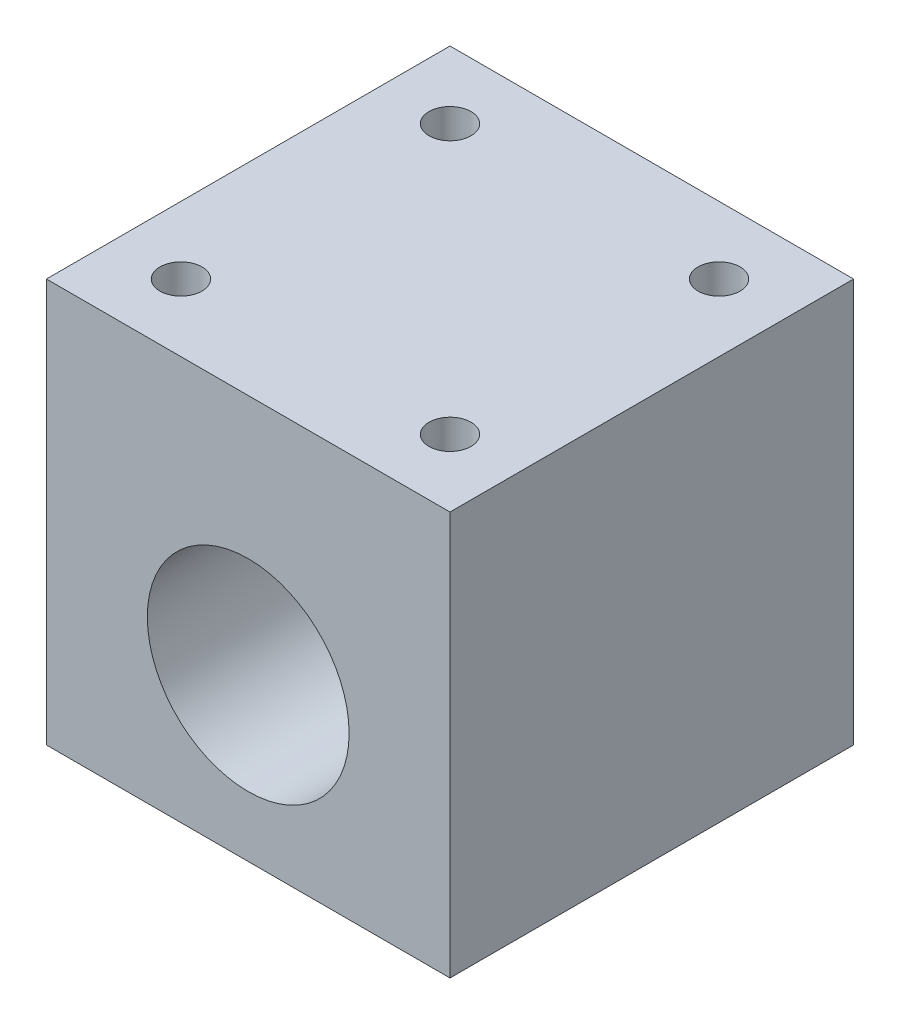
ISO-10303-21;
HEADER;
FILE_DESCRIPTION(('STEP AP214'),'2;1');
FILE_NAME('part.step','',(''),(''),'','','');
FILE_SCHEMA(('AUTOMOTIVE_DESIGN { 1 0 10303 214 1 1 1 1 }'));
ENDSEC;
DATA;
#1=APPLICATION_CONTEXT('core data for automotive mechanical design processes');
#2=APPLICATION_PROTOCOL_DEFINITION('international standard','automotive_design',2000,#1);
#3=PRODUCT_CONTEXT('',#1,'mechanical');
#4=PRODUCT('Part','Part','',(#3));
#5=PRODUCT_RELATED_PRODUCT_CATEGORY('part','',(#4));
#6=PRODUCT_DEFINITION_FORMATION('','',#4);
#7=PRODUCT_DEFINITION_CONTEXT('part definition',#1,'design');
#8=PRODUCT_DEFINITION('design','',#6,#7);
#9=PRODUCT_DEFINITION_SHAPE('','',#8);
#10=(LENGTH_UNIT() NAMED_UNIT(*) SI_UNIT(.MILLI.,.METRE.));
#11=(NAMED_UNIT(*) PLANE_ANGLE_UNIT() SI_UNIT($,.RADIAN.));
#12=(NAMED_UNIT(*) SI_UNIT($,.STERADIAN.) SOLID_ANGLE_UNIT());
#13=UNCERTAINTY_MEASURE_WITH_UNIT(LENGTH_MEASURE(1.E-05),#10,'distance_accuracy_value','');
#14=(GEOMETRIC_REPRESENTATION_CONTEXT(3) GLOBAL_UNCERTAINTY_ASSIGNED_CONTEXT((#13)) GLOBAL_UNIT_ASSIGNED_CONTEXT((#10,
#11,#12)) REPRESENTATION_CONTEXT('',''));
#15=CARTESIAN_POINT('',(0.,0.,0.));
#16=DIRECTION('',(0.,0.,1.));
#17=DIRECTION('',(1.,0.,0.));
#18=AXIS2_PLACEMENT_3D('',#15,#16,#17);
#19=CARTESIAN_POINT('',(0.,0.,38.1));
#20=DIRECTION('',(1.,0.,0.));
#21=DIRECTION('',(0.,0.,-1.));
#22=AXIS2_PLACEMENT_3D('',#19,#20,#21);
#23=PLANE('',#22);
#24=DIRECTION('',(0.,-1.,0.));
#25=VECTOR('',#24,1.);
#26=CARTESIAN_POINT('',(0.,0.,0.));
#27=LINE('',#26,#25);
#28=CARTESIAN_POINT('',(0.,0.,0.));
#29=VERTEX_POINT('',#28);
#30=CARTESIAN_POINT('',(0.,-38.1,0.));
#31=VERTEX_POINT('',#30);
#32=EDGE_CURVE('E97',#29,#31,#27,.T.);
#33=ORIENTED_EDGE('',*,*,#32,.T.);
#34=DIRECTION('',(0.,0.,-1.));
#35=VECTOR('',#34,1.);
#36=CARTESIAN_POINT('',(0.,-38.1,38.1));
#37=LINE('',#36,#35);
#38=CARTESIAN_POINT('',(0.,-38.1,38.1));
#39=VERTEX_POINT('',#38);
#40=EDGE_CURVE('E11',#39,#31,#37,.T.);
#41=ORIENTED_EDGE('',*,*,#40,.F.);
#42=DIRECTION('',(0.,-1.,0.));
#43=VECTOR('',#42,1.);
#44=CARTESIAN_POINT('',(0.,0.,38.1));
#45=LINE('',#44,#43);
#46=CARTESIAN_POINT('',(0.,0.,38.1));
#47=VERTEX_POINT('',#46);
#48=EDGE_CURVE('E85',#47,#39,#45,.T.);
#49=ORIENTED_EDGE('',*,*,#48,.F.);
#50=DIRECTION('',(0.,0.,-1.));
#51=VECTOR('',#50,1.);
#52=CARTESIAN_POINT('',(0.,0.,38.1));
#53=LINE('',#52,#51);
#54=EDGE_CURVE('E93',#47,#29,#53,.T.);
#55=ORIENTED_EDGE('',*,*,#54,.T.);
#56=EDGE_LOOP('',(#33,#41,#49,#55));
#57=FACE_BOUND('',#56,.T.);
#58=ADVANCED_FACE('F34',(#57),#23,.F.);
#59=CARTESIAN_POINT('',(0.,-38.1,38.1));
#60=DIRECTION('',(0.,1.,0.));
#61=DIRECTION('',(0.,0.,1.));
#62=AXIS2_PLACEMENT_3D('',#59,#60,#61);
#63=PLANE('',#62);
#64=DIRECTION('',(1.,0.,0.));
#65=VECTOR('',#64,1.);
#66=CARTESIAN_POINT('',(0.,-38.1,0.));
#67=LINE('',#66,#65);
#68=CARTESIAN_POINT('',(38.1,-38.1,0.));
#69=VERTEX_POINT('',#68);
#70=EDGE_CURVE('E89',#31,#69,#67,.T.);
#71=ORIENTED_EDGE('',*,*,#70,.T.);
#72=DIRECTION('',(0.,0.,-1.));
#73=VECTOR('',#72,1.);
#74=CARTESIAN_POINT('',(38.1,-38.1,38.1));
#75=LINE('',#74,#73);
#76=CARTESIAN_POINT('',(38.1,-38.1,38.1));
#77=VERTEX_POINT('',#76);
#78=EDGE_CURVE('E42',#77,#69,#75,.T.);
#79=ORIENTED_EDGE('',*,*,#78,.F.);
#80=DIRECTION('',(1.,0.,0.));
#81=VECTOR('',#80,1.);
#82=CARTESIAN_POINT('',(0.,-38.1,38.1));
#83=LINE('',#82,#81);
#84=EDGE_CURVE('E80',#39,#77,#83,.T.);
#85=ORIENTED_EDGE('',*,*,#84,.F.);
#86=ORIENTED_EDGE('',*,*,#40,.T.);
#87=EDGE_LOOP('',(#71,#79,#85,#86));
#88=FACE_BOUND('',#87,.T.);
#89=ADVANCED_FACE('F88',(#88),#63,.F.);
#90=CARTESIAN_POINT('',(38.1,0.,38.1));
#91=DIRECTION('',(-1.,0.,0.));
#92=DIRECTION('',(0.,-1.,0.));
#93=AXIS2_PLACEMENT_3D('',#90,#91,#92);
#94=PLANE('',#93);
#95=DIRECTION('',(0.,1.,0.));
#96=VECTOR('',#95,1.);
#97=CARTESIAN_POINT('',(38.1,0.,0.));
#98=LINE('',#97,#96);
#99=CARTESIAN_POINT('',(38.1,0.,0.));
#100=VERTEX_POINT('',#99);
#101=EDGE_CURVE('E67',#69,#100,#98,.T.);
#102=ORIENTED_EDGE('',*,*,#101,.T.);
#103=DIRECTION('',(0.,0.,-1.));
#104=VECTOR('',#103,1.);
#105=CARTESIAN_POINT('',(38.1,0.,38.1));
#106=LINE('',#105,#104);
#107=CARTESIAN_POINT('',(38.1,0.,38.1));
#108=VERTEX_POINT('',#107);
#109=EDGE_CURVE('E90',#108,#100,#106,.T.);
#110=ORIENTED_EDGE('',*,*,#109,.F.);
#111=DIRECTION('',(0.,1.,0.));
#112=VECTOR('',#111,1.);
#113=CARTESIAN_POINT('',(38.1,0.,38.1));
#114=LINE('',#113,#112);
#115=EDGE_CURVE('E83',#77,#108,#114,.T.);
#116=ORIENTED_EDGE('',*,*,#115,.F.);
#117=ORIENTED_EDGE('',*,*,#78,.T.);
#118=EDGE_LOOP('',(#102,#110,#116,#117));
#119=FACE_BOUND('',#118,.T.);
#120=ADVANCED_FACE('F91',(#119),#94,.F.);
#121=CARTESIAN_POINT('',(0.,0.,38.1));
#122=DIRECTION('',(0.,-1.,0.));
#123=DIRECTION('',(0.,0.,-1.));
#124=AXIS2_PLACEMENT_3D('',#121,#122,#123);
#125=PLANE('',#124);
#126=CARTESIAN_POINT('',(6.35,0.,31.75));
#127=DIRECTION('',(0.,1.,0.));
#128=DIRECTION('',(0.,0.,-1.));
#129=AXIS2_PLACEMENT_3D('',#126,#127,#128);
#130=CIRCLE('',#129,1.984375);
#131=CARTESIAN_POINT('',(6.35,0.,29.765625));
#132=VERTEX_POINT('',#131);
#133=EDGE_CURVE('E124',#132,#132,#130,.T.);
#134=ORIENTED_EDGE('',*,*,#133,.F.);
#135=EDGE_LOOP('',(#134));
#136=FACE_BOUND('',#135,.T.);
#137=CARTESIAN_POINT('',(31.75,0.,6.35));
#138=DIRECTION('',(0.,1.,0.));
#139=DIRECTION('',(0.,0.,-1.));
#140=AXIS2_PLACEMENT_3D('',#137,#138,#139);
#141=CIRCLE('',#140,1.984375);
#142=CARTESIAN_POINT('',(31.75,0.,4.365625));
#143=VERTEX_POINT('',#142);
#144=EDGE_CURVE('E117',#143,#143,#141,.T.);
#145=ORIENTED_EDGE('',*,*,#144,.F.);
#146=EDGE_LOOP('',(#145));
#147=FACE_BOUND('',#146,.T.);
#148=CARTESIAN_POINT('',(31.75,0.,31.75));
#149=DIRECTION('',(0.,1.,0.));
#150=DIRECTION('',(0.,0.,1.));
#151=AXIS2_PLACEMENT_3D('',#148,#149,#150);
#152=CIRCLE('',#151,1.98437499999999);
#153=CARTESIAN_POINT('',(31.75,0.,33.734375));
#154=VERTEX_POINT('',#153);
#155=EDGE_CURVE('E129',#154,#154,#152,.T.);
#156=ORIENTED_EDGE('',*,*,#155,.F.);
#157=EDGE_LOOP('',(#156));
#158=FACE_BOUND('',#157,.T.);
#159=CARTESIAN_POINT('',(6.35,0.,6.35));
#160=DIRECTION('',(0.,1.,0.));
#161=DIRECTION('',(0.,0.,1.));
#162=AXIS2_PLACEMENT_3D('',#159,#160,#161);
#163=CIRCLE('',#162,1.984375);
#164=CARTESIAN_POINT('',(6.35,0.,8.334375));
#165=VERTEX_POINT('',#164);
#166=EDGE_CURVE('E111',#165,#165,#163,.T.);
#167=ORIENTED_EDGE('',*,*,#166,.F.);
#168=EDGE_LOOP('',(#167));
#169=FACE_BOUND('',#168,.T.);
#170=DIRECTION('',(-1.,0.,0.));
#171=VECTOR('',#170,1.);
#172=CARTESIAN_POINT('',(0.,0.,0.));
#173=LINE('',#172,#171);
#174=EDGE_CURVE('E73',#100,#29,#173,.T.);
#175=ORIENTED_EDGE('',*,*,#174,.T.);
#176=ORIENTED_EDGE('',*,*,#54,.F.);
#177=DIRECTION('',(-1.,0.,0.));
#178=VECTOR('',#177,1.);
#179=CARTESIAN_POINT('',(0.,0.,38.1));
#180=LINE('',#179,#178);
#181=EDGE_CURVE('E50',#108,#47,#180,.T.);
#182=ORIENTED_EDGE('',*,*,#181,.F.);
#183=ORIENTED_EDGE('',*,*,#109,.T.);
#184=EDGE_LOOP('',(#175,#176,#182,#183));
#185=FACE_BOUND('',#184,.T.);
#186=ADVANCED_FACE('F105',(#136,#147,#158,#169,#185),#125,.F.);
#187=CARTESIAN_POINT('',(0.,0.,38.1));
#188=DIRECTION('',(0.,0.,1.));
#189=DIRECTION('',(1.,0.,0.));
#190=AXIS2_PLACEMENT_3D('',#187,#188,#189);
#191=PLANE('',#190);
#192=CARTESIAN_POINT('',(19.05,-22.86,38.1));
#193=DIRECTION('',(0.,0.,1.));
#194=DIRECTION('',(1.,0.,0.));
#195=AXIS2_PLACEMENT_3D('',#192,#193,#194);
#196=CIRCLE('',#195,9.525);
#197=CARTESIAN_POINT('',(28.575,-22.86,38.1));
#198=VERTEX_POINT('',#197);
#199=EDGE_CURVE('E137',#198,#198,#196,.T.);
#200=ORIENTED_EDGE('',*,*,#199,.F.);
#201=EDGE_LOOP('',(#200));
#202=FACE_BOUND('',#201,.T.);
#203=ORIENTED_EDGE('',*,*,#48,.T.);
#204=ORIENTED_EDGE('',*,*,#84,.T.);
#205=ORIENTED_EDGE('',*,*,#115,.T.);
#206=ORIENTED_EDGE('',*,*,#181,.T.);
#207=EDGE_LOOP('',(#203,#204,#205,#206));
#208=FACE_BOUND('',#207,.T.);
#209=ADVANCED_FACE('F81',(#202,#208),#191,.T.);
#210=CARTESIAN_POINT('',(0.,0.,0.));
#211=DIRECTION('',(0.,0.,1.));
#212=DIRECTION('',(1.,0.,0.));
#213=AXIS2_PLACEMENT_3D('',#210,#211,#212);
#214=PLANE('',#213);
#215=CARTESIAN_POINT('',(19.05,-22.86,0.));
#216=DIRECTION('',(0.,0.,1.));
#217=DIRECTION('',(1.,0.,0.));
#218=AXIS2_PLACEMENT_3D('',#215,#216,#217);
#219=CIRCLE('',#218,9.52499999999999);
#220=CARTESIAN_POINT('',(28.575,-22.86,0.));
#221=VERTEX_POINT('',#220);
#222=EDGE_CURVE('E132',#221,#221,#219,.T.);
#223=ORIENTED_EDGE('',*,*,#222,.T.);
#224=EDGE_LOOP('',(#223));
#225=FACE_BOUND('',#224,.T.);
#226=ORIENTED_EDGE('',*,*,#32,.F.);
#227=ORIENTED_EDGE('',*,*,#174,.F.);
#228=ORIENTED_EDGE('',*,*,#101,.F.);
#229=ORIENTED_EDGE('',*,*,#70,.F.);
#230=EDGE_LOOP('',(#226,#227,#228,#229));
#231=FACE_BOUND('',#230,.T.);
#232=ADVANCED_FACE('F108',(#225,#231),#214,.F.);
#233=CARTESIAN_POINT('',(6.35,-19.05,6.35));
#234=DIRECTION('',(0.,1.,0.));
#235=DIRECTION('',(0.,0.,1.));
#236=AXIS2_PLACEMENT_3D('',#233,#234,#235);
#237=CYLINDRICAL_SURFACE('',#236,1.984375);
#238=CARTESIAN_POINT('',(6.35,-19.05,6.35));
#239=DIRECTION('',(0.,1.,0.));
#240=DIRECTION('',(0.,0.,1.));
#241=AXIS2_PLACEMENT_3D('',#238,#239,#240);
#242=CIRCLE('',#241,1.984375);
#243=CARTESIAN_POINT('',(6.35,-19.05,8.334375));
#244=VERTEX_POINT('',#243);
#245=EDGE_CURVE('E100',#244,#244,#242,.T.);
#246=ORIENTED_EDGE('',*,*,#245,.F.);
#247=EDGE_LOOP('',(#246));
#248=FACE_BOUND('',#247,.T.);
#249=ORIENTED_EDGE('',*,*,#166,.T.);
#250=EDGE_LOOP('',(#249));
#251=FACE_BOUND('',#250,.T.);
#252=ADVANCED_FACE('F149',(#248,#251),#237,.F.);
#253=CARTESIAN_POINT('',(6.35,-19.05,6.35));
#254=DIRECTION('',(0.,1.,0.));
#255=DIRECTION('',(0.,0.,1.));
#256=AXIS2_PLACEMENT_3D('',#253,#254,#255);
#257=PLANE('',#256);
#258=ORIENTED_EDGE('',*,*,#245,.T.);
#259=EDGE_LOOP('',(#258));
#260=FACE_BOUND('',#259,.T.);
#261=ADVANCED_FACE('F179',(#260),#257,.T.);
#262=CARTESIAN_POINT('',(31.75,-19.05,31.75));
#263=DIRECTION('',(0.,1.,0.));
#264=DIRECTION('',(0.,0.,1.));
#265=AXIS2_PLACEMENT_3D('',#262,#263,#264);
#266=CYLINDRICAL_SURFACE('',#265,1.98437499999999);
#267=CARTESIAN_POINT('',(31.75,-19.05,31.75));
#268=DIRECTION('',(0.,1.,0.));
#269=DIRECTION('',(0.,0.,1.));
#270=AXIS2_PLACEMENT_3D('',#267,#268,#269);
#271=CIRCLE('',#270,1.98437499999999);
#272=CARTESIAN_POINT('',(31.75,-19.05,33.734375));
#273=VERTEX_POINT('',#272);
#274=EDGE_CURVE('E121',#273,#273,#271,.T.);
#275=ORIENTED_EDGE('',*,*,#274,.F.);
#276=EDGE_LOOP('',(#275));
#277=FACE_BOUND('',#276,.T.);
#278=ORIENTED_EDGE('',*,*,#155,.T.);
#279=EDGE_LOOP('',(#278));
#280=FACE_BOUND('',#279,.T.);
#281=ADVANCED_FACE('F189',(#277,#280),#266,.F.);
#282=CARTESIAN_POINT('',(31.75,-19.05,31.75));
#283=DIRECTION('',(0.,1.,0.));
#284=DIRECTION('',(0.,0.,1.));
#285=AXIS2_PLACEMENT_3D('',#282,#283,#284);
#286=PLANE('',#285);
#287=ORIENTED_EDGE('',*,*,#274,.T.);
#288=EDGE_LOOP('',(#287));
#289=FACE_BOUND('',#288,.T.);
#290=ADVANCED_FACE('F199',(#289),#286,.T.);
#291=CARTESIAN_POINT('',(31.75,-19.05,6.35));
#292=DIRECTION('',(0.,1.,0.));
#293=DIRECTION('',(0.,0.,1.));
#294=AXIS2_PLACEMENT_3D('',#291,#292,#293);
#295=CYLINDRICAL_SURFACE('',#294,1.984375);
#296=CARTESIAN_POINT('',(31.75,-19.05,6.35));
#297=DIRECTION('',(0.,1.,0.));
#298=DIRECTION('',(0.,0.,-1.));
#299=AXIS2_PLACEMENT_3D('',#296,#297,#298);
#300=CIRCLE('',#299,1.984375);
#301=CARTESIAN_POINT('',(31.75,-19.05,4.365625));
#302=VERTEX_POINT('',#301);
#303=EDGE_CURVE('E120',#302,#302,#300,.T.);
#304=ORIENTED_EDGE('',*,*,#303,.F.);
#305=EDGE_LOOP('',(#304));
#306=FACE_BOUND('',#305,.T.);
#307=ORIENTED_EDGE('',*,*,#144,.T.);
#308=EDGE_LOOP('',(#307));
#309=FACE_BOUND('',#308,.T.);
#310=ADVANCED_FACE('F209',(#306,#309),#295,.F.);
#311=CARTESIAN_POINT('',(31.75,-19.05,6.35));
#312=DIRECTION('',(0.,-1.,0.));
#313=DIRECTION('',(0.,0.,-1.));
#314=AXIS2_PLACEMENT_3D('',#311,#312,#313);
#315=PLANE('',#314);
#316=ORIENTED_EDGE('',*,*,#303,.T.);
#317=EDGE_LOOP('',(#316));
#318=FACE_BOUND('',#317,.T.);
#319=ADVANCED_FACE('F219',(#318),#315,.F.);
#320=CARTESIAN_POINT('',(6.35,-19.05,31.75));
#321=DIRECTION('',(0.,1.,0.));
#322=DIRECTION('',(0.,0.,1.));
#323=AXIS2_PLACEMENT_3D('',#320,#321,#322);
#324=CYLINDRICAL_SURFACE('',#323,1.984375);
#325=CARTESIAN_POINT('',(6.35,-19.05,31.75));
#326=DIRECTION('',(0.,1.,0.));
#327=DIRECTION('',(0.,0.,-1.));
#328=AXIS2_PLACEMENT_3D('',#325,#326,#327);
#329=CIRCLE('',#328,1.984375);
#330=CARTESIAN_POINT('',(6.35,-19.05,29.765625));
#331=VERTEX_POINT('',#330);
#332=EDGE_CURVE('E114',#331,#331,#329,.T.);
#333=ORIENTED_EDGE('',*,*,#332,.F.);
#334=EDGE_LOOP('',(#333));
#335=FACE_BOUND('',#334,.T.);
#336=ORIENTED_EDGE('',*,*,#133,.T.);
#337=EDGE_LOOP('',(#336));
#338=FACE_BOUND('',#337,.T.);
#339=ADVANCED_FACE('F229',(#335,#338),#324,.F.);
#340=CARTESIAN_POINT('',(6.35,-19.05,31.75));
#341=DIRECTION('',(0.,-1.,0.));
#342=DIRECTION('',(0.,0.,-1.));
#343=AXIS2_PLACEMENT_3D('',#340,#341,#342);
#344=PLANE('',#343);
#345=ORIENTED_EDGE('',*,*,#332,.T.);
#346=EDGE_LOOP('',(#345));
#347=FACE_BOUND('',#346,.T.);
#348=ADVANCED_FACE('F239',(#347),#344,.F.);
#349=CARTESIAN_POINT('',(19.05,-22.86,38.1));
#350=DIRECTION('',(0.,0.,1.));
#351=DIRECTION('',(1.,0.,0.));
#352=AXIS2_PLACEMENT_3D('',#349,#350,#351);
#353=CYLINDRICAL_SURFACE('',#352,9.52499999999999);
#354=ORIENTED_EDGE('',*,*,#222,.F.);
#355=EDGE_LOOP('',(#354));
#356=FACE_BOUND('',#355,.T.);
#357=ORIENTED_EDGE('',*,*,#199,.T.);
#358=EDGE_LOOP('',(#357));
#359=FACE_BOUND('',#358,.T.);
#360=ADVANCED_FACE('F141',(#356,#359),#353,.F.);
#361=CLOSED_SHELL('',(#58,#89,#120,#186,#209,#232,#252,#261,#281,#290,#310,#319,#339,#348,#360));
#362=MANIFOLD_SOLID_BREP('B2',#361);
#363=ADVANCED_BREP_SHAPE_REPRESENTATION('',(#18,#362),#14);
#364=SHAPE_DEFINITION_REPRESENTATION(#9,#363);
ENDSEC;
END-ISO-10303-21;
